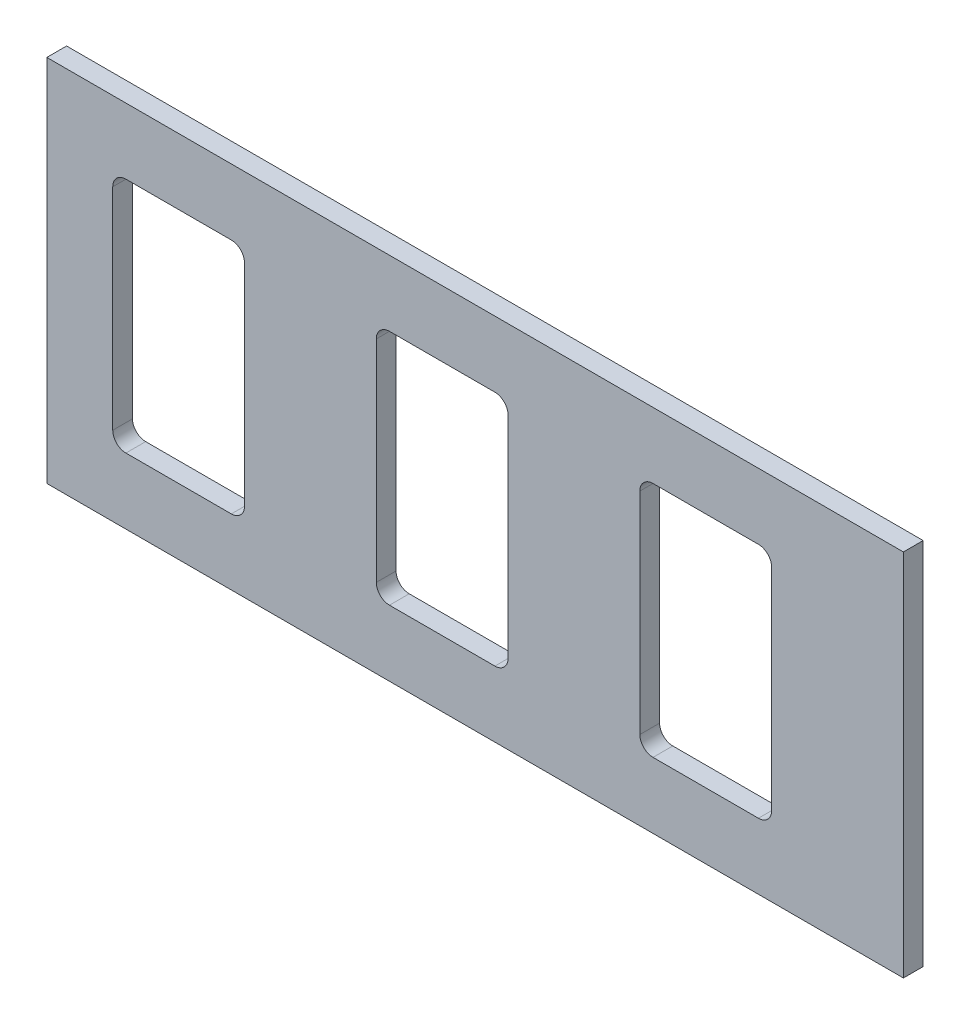
ISO-10303-21;
HEADER;
FILE_DESCRIPTION(('STEP AP214'),'2;1');
FILE_NAME('part.step','',(''),(''),'','','');
FILE_SCHEMA(('AUTOMOTIVE_DESIGN { 1 0 10303 214 1 1 1 1 }'));
ENDSEC;
DATA;
#1=APPLICATION_CONTEXT('core data for automotive mechanical design processes');
#2=APPLICATION_PROTOCOL_DEFINITION('international standard','automotive_design',2000,#1);
#3=PRODUCT_CONTEXT('',#1,'mechanical');
#4=PRODUCT('Part','Part','',(#3));
#5=PRODUCT_RELATED_PRODUCT_CATEGORY('part','',(#4));
#6=PRODUCT_DEFINITION_FORMATION('','',#4);
#7=PRODUCT_DEFINITION_CONTEXT('part definition',#1,'design');
#8=PRODUCT_DEFINITION('design','',#6,#7);
#9=PRODUCT_DEFINITION_SHAPE('','',#8);
#10=(LENGTH_UNIT() NAMED_UNIT(*) SI_UNIT(.MILLI.,.METRE.));
#11=(NAMED_UNIT(*) PLANE_ANGLE_UNIT() SI_UNIT($,.RADIAN.));
#12=(NAMED_UNIT(*) SI_UNIT($,.STERADIAN.) SOLID_ANGLE_UNIT());
#13=UNCERTAINTY_MEASURE_WITH_UNIT(LENGTH_MEASURE(1.E-05),#10,'distance_accuracy_value','');
#14=(GEOMETRIC_REPRESENTATION_CONTEXT(3) GLOBAL_UNCERTAINTY_ASSIGNED_CONTEXT((#13)) GLOBAL_UNIT_ASSIGNED_CONTEXT((#10,
#11,#12)) REPRESENTATION_CONTEXT('',''));
#15=CARTESIAN_POINT('',(0.,0.,0.));
#16=DIRECTION('',(0.,0.,1.));
#17=DIRECTION('',(1.,0.,0.));
#18=AXIS2_PLACEMENT_3D('',#15,#16,#17);
#19=CARTESIAN_POINT('',(-65.,-28.,3.));
#20=DIRECTION('',(1.,0.,0.));
#21=DIRECTION('',(0.,0.,-1.));
#22=AXIS2_PLACEMENT_3D('',#19,#20,#21);
#23=PLANE('',#22);
#24=DIRECTION('',(0.,-1.,0.));
#25=VECTOR('',#24,1.);
#26=CARTESIAN_POINT('',(-65.,-28.,0.));
#27=LINE('',#26,#25);
#28=CARTESIAN_POINT('',(-65.,28.,0.));
#29=VERTEX_POINT('',#28);
#30=CARTESIAN_POINT('',(-65.,-28.,0.));
#31=VERTEX_POINT('',#30);
#32=EDGE_CURVE('E246',#29,#31,#27,.T.);
#33=ORIENTED_EDGE('',*,*,#32,.T.);
#34=DIRECTION('',(0.,0.,-1.));
#35=VECTOR('',#34,1.);
#36=CARTESIAN_POINT('',(-65.,-28.,3.));
#37=LINE('',#36,#35);
#38=CARTESIAN_POINT('',(-65.,-28.,3.));
#39=VERTEX_POINT('',#38);
#40=EDGE_CURVE('E227',#39,#31,#37,.T.);
#41=ORIENTED_EDGE('',*,*,#40,.F.);
#42=DIRECTION('',(0.,-1.,0.));
#43=VECTOR('',#42,1.);
#44=CARTESIAN_POINT('',(-65.,-28.,3.));
#45=LINE('',#44,#43);
#46=CARTESIAN_POINT('',(-65.,28.,3.));
#47=VERTEX_POINT('',#46);
#48=EDGE_CURVE('E234',#47,#39,#45,.T.);
#49=ORIENTED_EDGE('',*,*,#48,.F.);
#50=DIRECTION('',(0.,0.,-1.));
#51=VECTOR('',#50,1.);
#52=CARTESIAN_POINT('',(-65.,28.,3.));
#53=LINE('',#52,#51);
#54=EDGE_CURVE('E464',#47,#29,#53,.T.);
#55=ORIENTED_EDGE('',*,*,#54,.T.);
#56=EDGE_LOOP('',(#33,#41,#49,#55));
#57=FACE_BOUND('',#56,.T.);
#58=ADVANCED_FACE('F37',(#57),#23,.F.);
#59=CARTESIAN_POINT('',(65.,-28.,3.));
#60=DIRECTION('',(0.,1.,0.));
#61=DIRECTION('',(-1.,0.,0.));
#62=AXIS2_PLACEMENT_3D('',#59,#60,#61);
#63=PLANE('',#62);
#64=DIRECTION('',(1.,0.,0.));
#65=VECTOR('',#64,1.);
#66=CARTESIAN_POINT('',(65.,-28.,0.));
#67=LINE('',#66,#65);
#68=CARTESIAN_POINT('',(65.,-28.,0.));
#69=VERTEX_POINT('',#68);
#70=EDGE_CURVE('E466',#31,#69,#67,.T.);
#71=ORIENTED_EDGE('',*,*,#70,.T.);
#72=DIRECTION('',(0.,0.,-1.));
#73=VECTOR('',#72,1.);
#74=CARTESIAN_POINT('',(65.,-28.,3.));
#75=LINE('',#74,#73);
#76=CARTESIAN_POINT('',(65.,-28.,3.));
#77=VERTEX_POINT('',#76);
#78=EDGE_CURVE('E230',#77,#69,#75,.T.);
#79=ORIENTED_EDGE('',*,*,#78,.F.);
#80=DIRECTION('',(1.,0.,0.));
#81=VECTOR('',#80,1.);
#82=CARTESIAN_POINT('',(65.,-28.,3.));
#83=LINE('',#82,#81);
#84=EDGE_CURVE('E223',#39,#77,#83,.T.);
#85=ORIENTED_EDGE('',*,*,#84,.F.);
#86=ORIENTED_EDGE('',*,*,#40,.T.);
#87=EDGE_LOOP('',(#71,#79,#85,#86));
#88=FACE_BOUND('',#87,.T.);
#89=ADVANCED_FACE('F225',(#88),#63,.F.);
#90=CARTESIAN_POINT('',(65.,-28.,3.));
#91=DIRECTION('',(-1.,0.,0.));
#92=DIRECTION('',(0.,0.,1.));
#93=AXIS2_PLACEMENT_3D('',#90,#91,#92);
#94=PLANE('',#93);
#95=DIRECTION('',(0.,1.,0.));
#96=VECTOR('',#95,1.);
#97=CARTESIAN_POINT('',(65.,-28.,0.));
#98=LINE('',#97,#96);
#99=CARTESIAN_POINT('',(65.,28.,0.));
#100=VERTEX_POINT('',#99);
#101=EDGE_CURVE('E468',#69,#100,#98,.T.);
#102=ORIENTED_EDGE('',*,*,#101,.T.);
#103=DIRECTION('',(0.,0.,-1.));
#104=VECTOR('',#103,1.);
#105=CARTESIAN_POINT('',(65.,28.,3.));
#106=LINE('',#105,#104);
#107=CARTESIAN_POINT('',(65.,28.,3.));
#108=VERTEX_POINT('',#107);
#109=EDGE_CURVE('E252',#108,#100,#106,.T.);
#110=ORIENTED_EDGE('',*,*,#109,.F.);
#111=DIRECTION('',(0.,1.,0.));
#112=VECTOR('',#111,1.);
#113=CARTESIAN_POINT('',(65.,-28.,3.));
#114=LINE('',#113,#112);
#115=EDGE_CURVE('E233',#77,#108,#114,.T.);
#116=ORIENTED_EDGE('',*,*,#115,.F.);
#117=ORIENTED_EDGE('',*,*,#78,.T.);
#118=EDGE_LOOP('',(#102,#110,#116,#117));
#119=FACE_BOUND('',#118,.T.);
#120=ADVANCED_FACE('F479',(#119),#94,.F.);
#121=CARTESIAN_POINT('',(65.,28.,3.));
#122=DIRECTION('',(0.,-1.,0.));
#123=DIRECTION('',(1.,0.,0.));
#124=AXIS2_PLACEMENT_3D('',#121,#122,#123);
#125=PLANE('',#124);
#126=DIRECTION('',(-1.,0.,0.));
#127=VECTOR('',#126,1.);
#128=CARTESIAN_POINT('',(65.,28.,0.));
#129=LINE('',#128,#127);
#130=EDGE_CURVE('E243',#100,#29,#129,.T.);
#131=ORIENTED_EDGE('',*,*,#130,.T.);
#132=ORIENTED_EDGE('',*,*,#54,.F.);
#133=DIRECTION('',(-1.,0.,0.));
#134=VECTOR('',#133,1.);
#135=CARTESIAN_POINT('',(65.,28.,3.));
#136=LINE('',#135,#134);
#137=EDGE_CURVE('E239',#108,#47,#136,.T.);
#138=ORIENTED_EDGE('',*,*,#137,.F.);
#139=ORIENTED_EDGE('',*,*,#109,.T.);
#140=EDGE_LOOP('',(#131,#132,#138,#139));
#141=FACE_BOUND('',#140,.T.);
#142=ADVANCED_FACE('F475',(#141),#125,.F.);
#143=CARTESIAN_POINT('',(0.,0.,3.));
#144=DIRECTION('',(0.,0.,1.));
#145=DIRECTION('',(1.,0.,0.));
#146=AXIS2_PLACEMENT_3D('',#143,#144,#145);
#147=PLANE('',#146);
#148=DIRECTION('',(-1.,0.,0.));
#149=VECTOR('',#148,1.);
#150=CARTESIAN_POINT('',(-34.9999999999999,18.,3.));
#151=LINE('',#150,#149);
#152=CARTESIAN_POINT('',(-36.9999999999999,18.,3.));
#153=VERTEX_POINT('',#152);
#154=CARTESIAN_POINT('',(-52.9999999999999,18.,3.));
#155=VERTEX_POINT('',#154);
#156=EDGE_CURVE('E403',#153,#155,#151,.T.);
#157=ORIENTED_EDGE('',*,*,#156,.F.);
#158=CARTESIAN_POINT('',(-36.9999999999999,16.,3.));
#159=DIRECTION('',(0.,0.,1.));
#160=DIRECTION('',(1.,0.,0.));
#161=AXIS2_PLACEMENT_3D('',#158,#159,#160);
#162=CIRCLE('',#161,2.);
#163=CARTESIAN_POINT('',(-34.9999999999999,16.,3.));
#164=VERTEX_POINT('',#163);
#165=EDGE_CURVE('E357',#153,#164,#162,.F.);
#166=ORIENTED_EDGE('',*,*,#165,.T.);
#167=DIRECTION('',(0.,1.,0.));
#168=VECTOR('',#167,1.);
#169=CARTESIAN_POINT('',(-34.9999999999999,-18.,3.));
#170=LINE('',#169,#168);
#171=CARTESIAN_POINT('',(-34.9999999999999,-16.,3.));
#172=VERTEX_POINT('',#171);
#173=EDGE_CURVE('E423',#172,#164,#170,.T.);
#174=ORIENTED_EDGE('',*,*,#173,.F.);
#175=CARTESIAN_POINT('',(-36.9999999999999,-16.,3.));
#176=DIRECTION('',(0.,0.,1.));
#177=DIRECTION('',(1.,0.,0.));
#178=AXIS2_PLACEMENT_3D('',#175,#176,#177);
#179=CIRCLE('',#178,2.);
#180=CARTESIAN_POINT('',(-36.9999999999999,-18.,3.));
#181=VERTEX_POINT('',#180);
#182=EDGE_CURVE('E369',#172,#181,#179,.F.);
#183=ORIENTED_EDGE('',*,*,#182,.T.);
#184=DIRECTION('',(1.,0.,0.));
#185=VECTOR('',#184,1.);
#186=CARTESIAN_POINT('',(-54.9999999999999,-18.,3.));
#187=LINE('',#186,#185);
#188=CARTESIAN_POINT('',(-52.9999999999999,-18.,3.));
#189=VERTEX_POINT('',#188);
#190=EDGE_CURVE('E395',#189,#181,#187,.T.);
#191=ORIENTED_EDGE('',*,*,#190,.F.);
#192=CARTESIAN_POINT('',(-52.9999999999999,-16.,3.));
#193=DIRECTION('',(0.,0.,1.));
#194=DIRECTION('',(1.,0.,0.));
#195=AXIS2_PLACEMENT_3D('',#192,#193,#194);
#196=CIRCLE('',#195,2.);
#197=CARTESIAN_POINT('',(-54.9999999999999,-16.,3.));
#198=VERTEX_POINT('',#197);
#199=EDGE_CURVE('E45',#189,#198,#196,.F.);
#200=ORIENTED_EDGE('',*,*,#199,.T.);
#201=DIRECTION('',(0.,-1.,0.));
#202=VECTOR('',#201,1.);
#203=CARTESIAN_POINT('',(-54.9999999999999,-18.,3.));
#204=LINE('',#203,#202);
#205=CARTESIAN_POINT('',(-54.9999999999999,16.,3.));
#206=VERTEX_POINT('',#205);
#207=EDGE_CURVE('E393',#206,#198,#204,.T.);
#208=ORIENTED_EDGE('',*,*,#207,.F.);
#209=CARTESIAN_POINT('',(-52.9999999999999,16.,3.));
#210=DIRECTION('',(0.,0.,1.));
#211=DIRECTION('',(1.,0.,0.));
#212=AXIS2_PLACEMENT_3D('',#209,#210,#211);
#213=CIRCLE('',#212,2.);
#214=EDGE_CURVE('E353',#206,#155,#213,.F.);
#215=ORIENTED_EDGE('',*,*,#214,.T.);
#216=EDGE_LOOP('',(#157,#166,#174,#183,#191,#200,#208,#215));
#217=FACE_BOUND('',#216,.T.);
#218=DIRECTION('',(-1.,0.,0.));
#219=VECTOR('',#218,1.);
#220=CARTESIAN_POINT('',(45.,18.,3.));
#221=LINE('',#220,#219);
#222=CARTESIAN_POINT('',(43.,18.,3.));
#223=VERTEX_POINT('',#222);
#224=CARTESIAN_POINT('',(27.,18.,3.));
#225=VERTEX_POINT('',#224);
#226=EDGE_CURVE('E444',#223,#225,#221,.T.);
#227=ORIENTED_EDGE('',*,*,#226,.F.);
#228=CARTESIAN_POINT('',(43.,16.,3.));
#229=DIRECTION('',(0.,0.,1.));
#230=DIRECTION('',(1.,0.,0.));
#231=AXIS2_PLACEMENT_3D('',#228,#229,#230);
#232=CIRCLE('',#231,2.);
#233=CARTESIAN_POINT('',(45.,16.,3.));
#234=VERTEX_POINT('',#233);
#235=EDGE_CURVE('E365',#223,#234,#232,.F.);
#236=ORIENTED_EDGE('',*,*,#235,.T.);
#237=DIRECTION('',(0.,1.,0.));
#238=VECTOR('',#237,1.);
#239=CARTESIAN_POINT('',(45.,-18.,3.));
#240=LINE('',#239,#238);
#241=CARTESIAN_POINT('',(45.,-16.,3.));
#242=VERTEX_POINT('',#241);
#243=EDGE_CURVE('E435',#242,#234,#240,.T.);
#244=ORIENTED_EDGE('',*,*,#243,.F.);
#245=CARTESIAN_POINT('',(43.,-16.,3.));
#246=DIRECTION('',(0.,0.,1.));
#247=DIRECTION('',(1.,0.,0.));
#248=AXIS2_PLACEMENT_3D('',#245,#246,#247);
#249=CIRCLE('',#248,2.);
#250=CARTESIAN_POINT('',(43.,-18.,3.));
#251=VERTEX_POINT('',#250);
#252=EDGE_CURVE('E377',#242,#251,#249,.F.);
#253=ORIENTED_EDGE('',*,*,#252,.T.);
#254=DIRECTION('',(1.,0.,0.));
#255=VECTOR('',#254,1.);
#256=CARTESIAN_POINT('',(25.,-18.,3.));
#257=LINE('',#256,#255);
#258=CARTESIAN_POINT('',(27.,-18.,3.));
#259=VERTEX_POINT('',#258);
#260=EDGE_CURVE('E438',#259,#251,#257,.T.);
#261=ORIENTED_EDGE('',*,*,#260,.F.);
#262=CARTESIAN_POINT('',(27.,-16.,3.));
#263=DIRECTION('',(0.,0.,1.));
#264=DIRECTION('',(1.,0.,0.));
#265=AXIS2_PLACEMENT_3D('',#262,#263,#264);
#266=CIRCLE('',#265,2.);
#267=CARTESIAN_POINT('',(25.,-16.,3.));
#268=VERTEX_POINT('',#267);
#269=EDGE_CURVE('E381',#259,#268,#266,.F.);
#270=ORIENTED_EDGE('',*,*,#269,.T.);
#271=DIRECTION('',(0.,-1.,0.));
#272=VECTOR('',#271,1.);
#273=CARTESIAN_POINT('',(25.,-18.,3.));
#274=LINE('',#273,#272);
#275=CARTESIAN_POINT('',(25.,16.,3.));
#276=VERTEX_POINT('',#275);
#277=EDGE_CURVE('E447',#276,#268,#274,.T.);
#278=ORIENTED_EDGE('',*,*,#277,.F.);
#279=CARTESIAN_POINT('',(27.,16.,3.));
#280=DIRECTION('',(0.,0.,1.));
#281=DIRECTION('',(1.,0.,0.));
#282=AXIS2_PLACEMENT_3D('',#279,#280,#281);
#283=CIRCLE('',#282,2.);
#284=EDGE_CURVE('E345',#276,#225,#283,.F.);
#285=ORIENTED_EDGE('',*,*,#284,.T.);
#286=EDGE_LOOP('',(#227,#236,#244,#253,#261,#270,#278,#285));
#287=FACE_BOUND('',#286,.T.);
#288=DIRECTION('',(1.,0.,0.));
#289=VECTOR('',#288,1.);
#290=CARTESIAN_POINT('',(-14.9999999999999,-18.,3.));
#291=LINE('',#290,#289);
#292=CARTESIAN_POINT('',(-12.9999999999999,-18.,3.));
#293=VERTEX_POINT('',#292);
#294=CARTESIAN_POINT('',(3.00000000000004,-18.,3.));
#295=VERTEX_POINT('',#294);
#296=EDGE_CURVE('E443',#293,#295,#291,.T.);
#297=ORIENTED_EDGE('',*,*,#296,.F.);
#298=CARTESIAN_POINT('',(-12.9999999999999,-16.,3.));
#299=DIRECTION('',(0.,0.,1.));
#300=DIRECTION('',(1.,0.,0.));
#301=AXIS2_PLACEMENT_3D('',#298,#299,#300);
#302=CIRCLE('',#301,2.);
#303=CARTESIAN_POINT('',(-14.9999999999999,-16.,3.));
#304=VERTEX_POINT('',#303);
#305=EDGE_CURVE('E384',#293,#304,#302,.F.);
#306=ORIENTED_EDGE('',*,*,#305,.T.);
#307=DIRECTION('',(0.,-1.,0.));
#308=VECTOR('',#307,1.);
#309=CARTESIAN_POINT('',(-14.9999999999999,-18.,3.));
#310=LINE('',#309,#308);
#311=CARTESIAN_POINT('',(-14.9999999999999,16.,3.));
#312=VERTEX_POINT('',#311);
#313=EDGE_CURVE('E459',#312,#304,#310,.T.);
#314=ORIENTED_EDGE('',*,*,#313,.F.);
#315=CARTESIAN_POINT('',(-12.9999999999999,16.,3.));
#316=DIRECTION('',(0.,0.,1.));
#317=DIRECTION('',(1.,0.,0.));
#318=AXIS2_PLACEMENT_3D('',#315,#316,#317);
#319=CIRCLE('',#318,2.);
#320=CARTESIAN_POINT('',(-12.9999999999999,18.,3.));
#321=VERTEX_POINT('',#320);
#322=EDGE_CURVE('E349',#312,#321,#319,.F.);
#323=ORIENTED_EDGE('',*,*,#322,.T.);
#324=DIRECTION('',(-1.,0.,0.));
#325=VECTOR('',#324,1.);
#326=CARTESIAN_POINT('',(5.00000000000004,18.,3.));
#327=LINE('',#326,#325);
#328=CARTESIAN_POINT('',(3.00000000000004,18.,3.));
#329=VERTEX_POINT('',#328);
#330=EDGE_CURVE('E456',#329,#321,#327,.T.);
#331=ORIENTED_EDGE('',*,*,#330,.F.);
#332=CARTESIAN_POINT('',(3.00000000000004,16.,3.));
#333=DIRECTION('',(0.,0.,1.));
#334=DIRECTION('',(1.,0.,0.));
#335=AXIS2_PLACEMENT_3D('',#332,#333,#334);
#336=CIRCLE('',#335,2.);
#337=CARTESIAN_POINT('',(5.00000000000004,16.,3.));
#338=VERTEX_POINT('',#337);
#339=EDGE_CURVE('E361',#329,#338,#336,.F.);
#340=ORIENTED_EDGE('',*,*,#339,.T.);
#341=DIRECTION('',(0.,1.,0.));
#342=VECTOR('',#341,1.);
#343=CARTESIAN_POINT('',(5.00000000000004,-18.,3.));
#344=LINE('',#343,#342);
#345=CARTESIAN_POINT('',(5.00000000000004,-16.,3.));
#346=VERTEX_POINT('',#345);
#347=EDGE_CURVE('E453',#346,#338,#344,.T.);
#348=ORIENTED_EDGE('',*,*,#347,.F.);
#349=CARTESIAN_POINT('',(3.00000000000004,-16.,3.));
#350=DIRECTION('',(0.,0.,1.));
#351=DIRECTION('',(1.,0.,0.));
#352=AXIS2_PLACEMENT_3D('',#349,#350,#351);
#353=CIRCLE('',#352,2.);
#354=EDGE_CURVE('E373',#346,#295,#353,.F.);
#355=ORIENTED_EDGE('',*,*,#354,.T.);
#356=EDGE_LOOP('',(#297,#306,#314,#323,#331,#340,#348,#355));
#357=FACE_BOUND('',#356,.T.);
#358=ORIENTED_EDGE('',*,*,#48,.T.);
#359=ORIENTED_EDGE('',*,*,#84,.T.);
#360=ORIENTED_EDGE('',*,*,#115,.T.);
#361=ORIENTED_EDGE('',*,*,#137,.T.);
#362=EDGE_LOOP('',(#358,#359,#360,#361));
#363=FACE_BOUND('',#362,.T.);
#364=ADVANCED_FACE('F237',(#217,#287,#357,#363),#147,.T.);
#365=CARTESIAN_POINT('',(0.,0.,0.));
#366=DIRECTION('',(0.,0.,1.));
#367=DIRECTION('',(1.,0.,0.));
#368=AXIS2_PLACEMENT_3D('',#365,#366,#367);
#369=PLANE('',#368);
#370=DIRECTION('',(1.,0.,0.));
#371=VECTOR('',#370,1.);
#372=CARTESIAN_POINT('',(0.,-18.,0.));
#373=LINE('',#372,#371);
#374=CARTESIAN_POINT('',(-52.9999999999999,-18.,0.));
#375=VERTEX_POINT('',#374);
#376=CARTESIAN_POINT('',(-36.9999999999999,-18.,0.));
#377=VERTEX_POINT('',#376);
#378=EDGE_CURVE('E277',#375,#377,#373,.T.);
#379=ORIENTED_EDGE('',*,*,#378,.T.);
#380=CARTESIAN_POINT('',(-36.9999999999999,-16.,0.));
#381=DIRECTION('',(0.,0.,1.));
#382=DIRECTION('',(1.,0.,0.));
#383=AXIS2_PLACEMENT_3D('',#380,#381,#382);
#384=CIRCLE('',#383,2.);
#385=CARTESIAN_POINT('',(-34.9999999999999,-16.,0.));
#386=VERTEX_POINT('',#385);
#387=EDGE_CURVE('E371',#377,#386,#384,.T.);
#388=ORIENTED_EDGE('',*,*,#387,.T.);
#389=DIRECTION('',(0.,1.,0.));
#390=VECTOR('',#389,1.);
#391=CARTESIAN_POINT('',(-34.9999999999999,0.,0.));
#392=LINE('',#391,#390);
#393=CARTESIAN_POINT('',(-34.9999999999999,16.,0.));
#394=VERTEX_POINT('',#393);
#395=EDGE_CURVE('E280',#386,#394,#392,.T.);
#396=ORIENTED_EDGE('',*,*,#395,.T.);
#397=CARTESIAN_POINT('',(-36.9999999999999,16.,0.));
#398=DIRECTION('',(0.,0.,1.));
#399=DIRECTION('',(1.,0.,0.));
#400=AXIS2_PLACEMENT_3D('',#397,#398,#399);
#401=CIRCLE('',#400,2.);
#402=CARTESIAN_POINT('',(-36.9999999999999,18.,0.));
#403=VERTEX_POINT('',#402);
#404=EDGE_CURVE('E359',#394,#403,#401,.T.);
#405=ORIENTED_EDGE('',*,*,#404,.T.);
#406=DIRECTION('',(-1.,0.,0.));
#407=VECTOR('',#406,1.);
#408=CARTESIAN_POINT('',(0.,18.,0.));
#409=LINE('',#408,#407);
#410=CARTESIAN_POINT('',(-52.9999999999999,18.,0.));
#411=VERTEX_POINT('',#410);
#412=EDGE_CURVE('E283',#403,#411,#409,.T.);
#413=ORIENTED_EDGE('',*,*,#412,.T.);
#414=CARTESIAN_POINT('',(-52.9999999999999,16.,0.));
#415=DIRECTION('',(0.,0.,1.));
#416=DIRECTION('',(1.,0.,0.));
#417=AXIS2_PLACEMENT_3D('',#414,#415,#416);
#418=CIRCLE('',#417,2.);
#419=CARTESIAN_POINT('',(-54.9999999999999,16.,0.));
#420=VERTEX_POINT('',#419);
#421=EDGE_CURVE('E355',#411,#420,#418,.T.);
#422=ORIENTED_EDGE('',*,*,#421,.T.);
#423=DIRECTION('',(0.,-1.,0.));
#424=VECTOR('',#423,1.);
#425=CARTESIAN_POINT('',(-54.9999999999999,0.,0.));
#426=LINE('',#425,#424);
#427=CARTESIAN_POINT('',(-54.9999999999999,-16.,0.));
#428=VERTEX_POINT('',#427);
#429=EDGE_CURVE('E274',#420,#428,#426,.T.);
#430=ORIENTED_EDGE('',*,*,#429,.T.);
#431=CARTESIAN_POINT('',(-52.9999999999999,-16.,0.));
#432=DIRECTION('',(0.,0.,1.));
#433=DIRECTION('',(1.,0.,0.));
#434=AXIS2_PLACEMENT_3D('',#431,#432,#433);
#435=CIRCLE('',#434,2.);
#436=EDGE_CURVE('E11',#428,#375,#435,.T.);
#437=ORIENTED_EDGE('',*,*,#436,.T.);
#438=EDGE_LOOP('',(#379,#388,#396,#405,#413,#422,#430,#437));
#439=FACE_BOUND('',#438,.T.);
#440=DIRECTION('',(1.,0.,0.));
#441=VECTOR('',#440,1.);
#442=CARTESIAN_POINT('',(0.,-18.,0.));
#443=LINE('',#442,#441);
#444=CARTESIAN_POINT('',(27.,-18.,0.));
#445=VERTEX_POINT('',#444);
#446=CARTESIAN_POINT('',(43.,-18.,0.));
#447=VERTEX_POINT('',#446);
#448=EDGE_CURVE('E266',#445,#447,#443,.T.);
#449=ORIENTED_EDGE('',*,*,#448,.T.);
#450=CARTESIAN_POINT('',(43.,-16.,0.));
#451=DIRECTION('',(0.,0.,1.));
#452=DIRECTION('',(1.,0.,0.));
#453=AXIS2_PLACEMENT_3D('',#450,#451,#452);
#454=CIRCLE('',#453,2.);
#455=CARTESIAN_POINT('',(45.,-16.,0.));
#456=VERTEX_POINT('',#455);
#457=EDGE_CURVE('E379',#447,#456,#454,.T.);
#458=ORIENTED_EDGE('',*,*,#457,.T.);
#459=DIRECTION('',(0.,1.,0.));
#460=VECTOR('',#459,1.);
#461=CARTESIAN_POINT('',(45.,0.,0.));
#462=LINE('',#461,#460);
#463=CARTESIAN_POINT('',(45.,16.,0.));
#464=VERTEX_POINT('',#463);
#465=EDGE_CURVE('E268',#456,#464,#462,.T.);
#466=ORIENTED_EDGE('',*,*,#465,.T.);
#467=CARTESIAN_POINT('',(43.,16.,0.));
#468=DIRECTION('',(0.,0.,1.));
#469=DIRECTION('',(1.,0.,0.));
#470=AXIS2_PLACEMENT_3D('',#467,#468,#469);
#471=CIRCLE('',#470,2.);
#472=CARTESIAN_POINT('',(43.,18.,0.));
#473=VERTEX_POINT('',#472);
#474=EDGE_CURVE('E367',#464,#473,#471,.T.);
#475=ORIENTED_EDGE('',*,*,#474,.T.);
#476=DIRECTION('',(-1.,0.,0.));
#477=VECTOR('',#476,1.);
#478=CARTESIAN_POINT('',(0.,18.,0.));
#479=LINE('',#478,#477);
#480=CARTESIAN_POINT('',(27.,18.,0.));
#481=VERTEX_POINT('',#480);
#482=EDGE_CURVE('E271',#473,#481,#479,.T.);
#483=ORIENTED_EDGE('',*,*,#482,.T.);
#484=CARTESIAN_POINT('',(27.,16.,0.));
#485=DIRECTION('',(0.,0.,1.));
#486=DIRECTION('',(1.,0.,0.));
#487=AXIS2_PLACEMENT_3D('',#484,#485,#486);
#488=CIRCLE('',#487,2.);
#489=CARTESIAN_POINT('',(25.,16.,0.));
#490=VERTEX_POINT('',#489);
#491=EDGE_CURVE('E347',#481,#490,#488,.T.);
#492=ORIENTED_EDGE('',*,*,#491,.T.);
#493=DIRECTION('',(0.,-1.,0.));
#494=VECTOR('',#493,1.);
#495=CARTESIAN_POINT('',(25.,0.,0.));
#496=LINE('',#495,#494);
#497=CARTESIAN_POINT('',(25.,-16.,0.));
#498=VERTEX_POINT('',#497);
#499=EDGE_CURVE('E264',#490,#498,#496,.T.);
#500=ORIENTED_EDGE('',*,*,#499,.T.);
#501=CARTESIAN_POINT('',(27.,-16.,0.));
#502=DIRECTION('',(0.,0.,1.));
#503=DIRECTION('',(1.,0.,0.));
#504=AXIS2_PLACEMENT_3D('',#501,#502,#503);
#505=CIRCLE('',#504,2.);
#506=EDGE_CURVE('E59',#498,#445,#505,.T.);
#507=ORIENTED_EDGE('',*,*,#506,.T.);
#508=EDGE_LOOP('',(#449,#458,#466,#475,#483,#492,#500,#507));
#509=FACE_BOUND('',#508,.T.);
#510=DIRECTION('',(-1.,0.,0.));
#511=VECTOR('',#510,1.);
#512=CARTESIAN_POINT('',(0.,18.,0.));
#513=LINE('',#512,#511);
#514=CARTESIAN_POINT('',(3.00000000000004,18.,0.));
#515=VERTEX_POINT('',#514);
#516=CARTESIAN_POINT('',(-12.9999999999999,18.,0.));
#517=VERTEX_POINT('',#516);
#518=EDGE_CURVE('E250',#515,#517,#513,.T.);
#519=ORIENTED_EDGE('',*,*,#518,.T.);
#520=CARTESIAN_POINT('',(-12.9999999999999,16.,0.));
#521=DIRECTION('',(0.,0.,1.));
#522=DIRECTION('',(1.,0.,0.));
#523=AXIS2_PLACEMENT_3D('',#520,#521,#522);
#524=CIRCLE('',#523,2.);
#525=CARTESIAN_POINT('',(-14.9999999999999,16.,0.));
#526=VERTEX_POINT('',#525);
#527=EDGE_CURVE('E351',#517,#526,#524,.T.);
#528=ORIENTED_EDGE('',*,*,#527,.T.);
#529=DIRECTION('',(0.,-1.,0.));
#530=VECTOR('',#529,1.);
#531=CARTESIAN_POINT('',(-14.9999999999999,0.,0.));
#532=LINE('',#531,#530);
#533=CARTESIAN_POINT('',(-14.9999999999999,-16.,0.));
#534=VERTEX_POINT('',#533);
#535=EDGE_CURVE('E258',#526,#534,#532,.T.);
#536=ORIENTED_EDGE('',*,*,#535,.T.);
#537=CARTESIAN_POINT('',(-12.9999999999999,-16.,0.));
#538=DIRECTION('',(0.,0.,1.));
#539=DIRECTION('',(1.,0.,0.));
#540=AXIS2_PLACEMENT_3D('',#537,#538,#539);
#541=CIRCLE('',#540,2.);
#542=CARTESIAN_POINT('',(-12.9999999999999,-18.,0.));
#543=VERTEX_POINT('',#542);
#544=EDGE_CURVE('E386',#534,#543,#541,.T.);
#545=ORIENTED_EDGE('',*,*,#544,.T.);
#546=DIRECTION('',(1.,0.,0.));
#547=VECTOR('',#546,1.);
#548=CARTESIAN_POINT('',(0.,-18.,0.));
#549=LINE('',#548,#547);
#550=CARTESIAN_POINT('',(3.00000000000004,-18.,0.));
#551=VERTEX_POINT('',#550);
#552=EDGE_CURVE('E261',#543,#551,#549,.T.);
#553=ORIENTED_EDGE('',*,*,#552,.T.);
#554=CARTESIAN_POINT('',(3.00000000000004,-16.,0.));
#555=DIRECTION('',(0.,0.,1.));
#556=DIRECTION('',(1.,0.,0.));
#557=AXIS2_PLACEMENT_3D('',#554,#555,#556);
#558=CIRCLE('',#557,2.);
#559=CARTESIAN_POINT('',(5.00000000000004,-16.,0.));
#560=VERTEX_POINT('',#559);
#561=EDGE_CURVE('E375',#551,#560,#558,.T.);
#562=ORIENTED_EDGE('',*,*,#561,.T.);
#563=DIRECTION('',(0.,1.,0.));
#564=VECTOR('',#563,1.);
#565=CARTESIAN_POINT('',(5.00000000000004,0.,0.));
#566=LINE('',#565,#564);
#567=CARTESIAN_POINT('',(5.00000000000004,16.,0.));
#568=VERTEX_POINT('',#567);
#569=EDGE_CURVE('E247',#560,#568,#566,.T.);
#570=ORIENTED_EDGE('',*,*,#569,.T.);
#571=CARTESIAN_POINT('',(3.00000000000004,16.,0.));
#572=DIRECTION('',(0.,0.,1.));
#573=DIRECTION('',(1.,0.,0.));
#574=AXIS2_PLACEMENT_3D('',#571,#572,#573);
#575=CIRCLE('',#574,2.);
#576=EDGE_CURVE('E363',#568,#515,#575,.T.);
#577=ORIENTED_EDGE('',*,*,#576,.T.);
#578=EDGE_LOOP('',(#519,#528,#536,#545,#553,#562,#570,#577));
#579=FACE_BOUND('',#578,.T.);
#580=ORIENTED_EDGE('',*,*,#32,.F.);
#581=ORIENTED_EDGE('',*,*,#130,.F.);
#582=ORIENTED_EDGE('',*,*,#101,.F.);
#583=ORIENTED_EDGE('',*,*,#70,.F.);
#584=EDGE_LOOP('',(#580,#581,#582,#583));
#585=FACE_BOUND('',#584,.T.);
#586=ADVANCED_FACE('F408',(#439,#509,#579,#585),#369,.F.);
#587=CARTESIAN_POINT('',(-14.9999999999999,-18.,-2.));
#588=DIRECTION('',(0.,-1.,0.));
#589=DIRECTION('',(1.,0.,0.));
#590=AXIS2_PLACEMENT_3D('',#587,#588,#589);
#591=PLANE('',#590);
#592=ORIENTED_EDGE('',*,*,#296,.T.);
#593=DIRECTION('',(0.,0.,1.));
#594=VECTOR('',#593,1.);
#595=CARTESIAN_POINT('',(3.00000000000004,-18.,0.));
#596=LINE('',#595,#594);
#597=EDGE_CURVE('E339',#295,#551,#596,.F.);
#598=ORIENTED_EDGE('',*,*,#597,.T.);
#599=ORIENTED_EDGE('',*,*,#552,.F.);
#600=DIRECTION('',(0.,0.,1.));
#601=VECTOR('',#600,1.);
#602=CARTESIAN_POINT('',(-12.9999999999999,-18.,3.));
#603=LINE('',#602,#601);
#604=EDGE_CURVE('E336',#543,#293,#603,.T.);
#605=ORIENTED_EDGE('',*,*,#604,.T.);
#606=EDGE_LOOP('',(#592,#598,#599,#605));
#607=FACE_BOUND('',#606,.T.);
#608=ADVANCED_FACE('F540',(#607),#591,.F.);
#609=CARTESIAN_POINT('',(-14.9999999999999,-18.,-2.));
#610=DIRECTION('',(-1.,0.,0.));
#611=DIRECTION('',(0.,0.,1.));
#612=AXIS2_PLACEMENT_3D('',#609,#610,#611);
#613=PLANE('',#612);
#614=ORIENTED_EDGE('',*,*,#535,.F.);
#615=DIRECTION('',(0.,0.,1.));
#616=VECTOR('',#615,1.);
#617=CARTESIAN_POINT('',(-14.9999999999999,16.,3.));
#618=LINE('',#617,#616);
#619=EDGE_CURVE('E298',#526,#312,#618,.T.);
#620=ORIENTED_EDGE('',*,*,#619,.T.);
#621=ORIENTED_EDGE('',*,*,#313,.T.);
#622=DIRECTION('',(0.,0.,1.));
#623=VECTOR('',#622,1.);
#624=CARTESIAN_POINT('',(-14.9999999999999,-16.,0.));
#625=LINE('',#624,#623);
#626=EDGE_CURVE('E296',#304,#534,#625,.F.);
#627=ORIENTED_EDGE('',*,*,#626,.T.);
#628=EDGE_LOOP('',(#614,#620,#621,#627));
#629=FACE_BOUND('',#628,.T.);
#630=ADVANCED_FACE('F559',(#629),#613,.F.);
#631=CARTESIAN_POINT('',(5.00000000000004,18.,-2.));
#632=DIRECTION('',(0.,1.,0.));
#633=DIRECTION('',(-1.,0.,0.));
#634=AXIS2_PLACEMENT_3D('',#631,#632,#633);
#635=PLANE('',#634);
#636=ORIENTED_EDGE('',*,*,#330,.T.);
#637=DIRECTION('',(0.,0.,1.));
#638=VECTOR('',#637,1.);
#639=CARTESIAN_POINT('',(-12.9999999999999,18.,0.));
#640=LINE('',#639,#638);
#641=EDGE_CURVE('E304',#321,#517,#640,.F.);
#642=ORIENTED_EDGE('',*,*,#641,.T.);
#643=ORIENTED_EDGE('',*,*,#518,.F.);
#644=DIRECTION('',(0.,0.,1.));
#645=VECTOR('',#644,1.);
#646=CARTESIAN_POINT('',(3.00000000000004,18.,3.));
#647=LINE('',#646,#645);
#648=EDGE_CURVE('E301',#515,#329,#647,.T.);
#649=ORIENTED_EDGE('',*,*,#648,.T.);
#650=EDGE_LOOP('',(#636,#642,#643,#649));
#651=FACE_BOUND('',#650,.T.);
#652=ADVANCED_FACE('F554',(#651),#635,.F.);
#653=CARTESIAN_POINT('',(5.00000000000004,-18.,-2.));
#654=DIRECTION('',(1.,0.,0.));
#655=DIRECTION('',(0.,0.,-1.));
#656=AXIS2_PLACEMENT_3D('',#653,#654,#655);
#657=PLANE('',#656);
#658=ORIENTED_EDGE('',*,*,#347,.T.);
#659=DIRECTION('',(0.,0.,1.));
#660=VECTOR('',#659,1.);
#661=CARTESIAN_POINT('',(5.00000000000004,16.,0.));
#662=LINE('',#661,#660);
#663=EDGE_CURVE('E324',#338,#568,#662,.F.);
#664=ORIENTED_EDGE('',*,*,#663,.T.);
#665=ORIENTED_EDGE('',*,*,#569,.F.);
#666=DIRECTION('',(0.,0.,1.));
#667=VECTOR('',#666,1.);
#668=CARTESIAN_POINT('',(5.00000000000004,-16.,3.));
#669=LINE('',#668,#667);
#670=EDGE_CURVE('E321',#560,#346,#669,.T.);
#671=ORIENTED_EDGE('',*,*,#670,.T.);
#672=EDGE_LOOP('',(#658,#664,#665,#671));
#673=FACE_BOUND('',#672,.T.);
#674=ADVANCED_FACE('F547',(#673),#657,.F.);
#675=CARTESIAN_POINT('',(45.,18.,-2.));
#676=DIRECTION('',(0.,1.,0.));
#677=DIRECTION('',(-1.,0.,0.));
#678=AXIS2_PLACEMENT_3D('',#675,#676,#677);
#679=PLANE('',#678);
#680=ORIENTED_EDGE('',*,*,#226,.T.);
#681=DIRECTION('',(0.,0.,1.));
#682=VECTOR('',#681,1.);
#683=CARTESIAN_POINT('',(27.,18.,0.));
#684=LINE('',#683,#682);
#685=EDGE_CURVE('E294',#225,#481,#684,.F.);
#686=ORIENTED_EDGE('',*,*,#685,.T.);
#687=ORIENTED_EDGE('',*,*,#482,.F.);
#688=DIRECTION('',(0.,0.,1.));
#689=VECTOR('',#688,1.);
#690=CARTESIAN_POINT('',(43.,18.,3.));
#691=LINE('',#690,#689);
#692=EDGE_CURVE('E291',#473,#223,#691,.T.);
#693=ORIENTED_EDGE('',*,*,#692,.T.);
#694=EDGE_LOOP('',(#680,#686,#687,#693));
#695=FACE_BOUND('',#694,.T.);
#696=ADVANCED_FACE('F573',(#695),#679,.F.);
#697=CARTESIAN_POINT('',(45.,-18.,-2.));
#698=DIRECTION('',(1.,0.,0.));
#699=DIRECTION('',(0.,0.,-1.));
#700=AXIS2_PLACEMENT_3D('',#697,#698,#699);
#701=PLANE('',#700);
#702=ORIENTED_EDGE('',*,*,#243,.T.);
#703=DIRECTION('',(0.,0.,1.));
#704=VECTOR('',#703,1.);
#705=CARTESIAN_POINT('',(45.,16.,0.));
#706=LINE('',#705,#704);
#707=EDGE_CURVE('E329',#234,#464,#706,.F.);
#708=ORIENTED_EDGE('',*,*,#707,.T.);
#709=ORIENTED_EDGE('',*,*,#465,.F.);
#710=DIRECTION('',(0.,0.,1.));
#711=VECTOR('',#710,1.);
#712=CARTESIAN_POINT('',(45.,-16.,3.));
#713=LINE('',#712,#711);
#714=EDGE_CURVE('E326',#456,#242,#713,.T.);
#715=ORIENTED_EDGE('',*,*,#714,.T.);
#716=EDGE_LOOP('',(#702,#708,#709,#715));
#717=FACE_BOUND('',#716,.T.);
#718=ADVANCED_FACE('F580',(#717),#701,.F.);
#719=CARTESIAN_POINT('',(25.,-18.,-2.));
#720=DIRECTION('',(0.,-1.,0.));
#721=DIRECTION('',(1.,0.,0.));
#722=AXIS2_PLACEMENT_3D('',#719,#720,#721);
#723=PLANE('',#722);
#724=ORIENTED_EDGE('',*,*,#260,.T.);
#725=DIRECTION('',(0.,0.,1.));
#726=VECTOR('',#725,1.);
#727=CARTESIAN_POINT('',(43.,-18.,0.));
#728=LINE('',#727,#726);
#729=EDGE_CURVE('E52',#251,#447,#728,.F.);
#730=ORIENTED_EDGE('',*,*,#729,.T.);
#731=ORIENTED_EDGE('',*,*,#448,.F.);
#732=DIRECTION('',(0.,0.,1.));
#733=VECTOR('',#732,1.);
#734=CARTESIAN_POINT('',(27.,-18.,3.));
#735=LINE('',#734,#733);
#736=EDGE_CURVE('E341',#445,#259,#735,.T.);
#737=ORIENTED_EDGE('',*,*,#736,.T.);
#738=EDGE_LOOP('',(#724,#730,#731,#737));
#739=FACE_BOUND('',#738,.T.);
#740=ADVANCED_FACE('F585',(#739),#723,.F.);
#741=CARTESIAN_POINT('',(25.,-18.,-2.));
#742=DIRECTION('',(-1.,0.,0.));
#743=DIRECTION('',(0.,0.,1.));
#744=AXIS2_PLACEMENT_3D('',#741,#742,#743);
#745=PLANE('',#744);
#746=ORIENTED_EDGE('',*,*,#499,.F.);
#747=DIRECTION('',(0.,0.,1.));
#748=VECTOR('',#747,1.);
#749=CARTESIAN_POINT('',(25.,16.,3.));
#750=LINE('',#749,#748);
#751=EDGE_CURVE('E288',#490,#276,#750,.T.);
#752=ORIENTED_EDGE('',*,*,#751,.T.);
#753=ORIENTED_EDGE('',*,*,#277,.T.);
#754=DIRECTION('',(0.,0.,1.));
#755=VECTOR('',#754,1.);
#756=CARTESIAN_POINT('',(25.,-16.,0.));
#757=LINE('',#756,#755);
#758=EDGE_CURVE('E286',#268,#498,#757,.F.);
#759=ORIENTED_EDGE('',*,*,#758,.T.);
#760=EDGE_LOOP('',(#746,#752,#753,#759));
#761=FACE_BOUND('',#760,.T.);
#762=ADVANCED_FACE('F582',(#761),#745,.F.);
#763=CARTESIAN_POINT('',(-34.9999999999999,18.,-2.));
#764=DIRECTION('',(0.,1.,0.));
#765=DIRECTION('',(-1.,0.,0.));
#766=AXIS2_PLACEMENT_3D('',#763,#764,#765);
#767=PLANE('',#766);
#768=ORIENTED_EDGE('',*,*,#156,.T.);
#769=DIRECTION('',(0.,0.,1.));
#770=VECTOR('',#769,1.);
#771=CARTESIAN_POINT('',(-52.9999999999999,18.,0.));
#772=LINE('',#771,#770);
#773=EDGE_CURVE('E314',#155,#411,#772,.F.);
#774=ORIENTED_EDGE('',*,*,#773,.T.);
#775=ORIENTED_EDGE('',*,*,#412,.F.);
#776=DIRECTION('',(0.,0.,1.));
#777=VECTOR('',#776,1.);
#778=CARTESIAN_POINT('',(-36.9999999999999,18.,3.));
#779=LINE('',#778,#777);
#780=EDGE_CURVE('E311',#403,#153,#779,.T.);
#781=ORIENTED_EDGE('',*,*,#780,.T.);
#782=EDGE_LOOP('',(#768,#774,#775,#781));
#783=FACE_BOUND('',#782,.T.);
#784=ADVANCED_FACE('F431',(#783),#767,.F.);
#785=CARTESIAN_POINT('',(-34.9999999999999,-18.,-2.));
#786=DIRECTION('',(1.,0.,0.));
#787=DIRECTION('',(0.,0.,-1.));
#788=AXIS2_PLACEMENT_3D('',#785,#786,#787);
#789=PLANE('',#788);
#790=ORIENTED_EDGE('',*,*,#173,.T.);
#791=DIRECTION('',(0.,0.,1.));
#792=VECTOR('',#791,1.);
#793=CARTESIAN_POINT('',(-34.9999999999999,16.,0.));
#794=LINE('',#793,#792);
#795=EDGE_CURVE('E319',#164,#394,#794,.F.);
#796=ORIENTED_EDGE('',*,*,#795,.T.);
#797=ORIENTED_EDGE('',*,*,#395,.F.);
#798=DIRECTION('',(0.,0.,1.));
#799=VECTOR('',#798,1.);
#800=CARTESIAN_POINT('',(-34.9999999999999,-16.,3.));
#801=LINE('',#800,#799);
#802=EDGE_CURVE('E316',#386,#172,#801,.T.);
#803=ORIENTED_EDGE('',*,*,#802,.T.);
#804=EDGE_LOOP('',(#790,#796,#797,#803));
#805=FACE_BOUND('',#804,.T.);
#806=ADVANCED_FACE('F420',(#805),#789,.F.);
#807=CARTESIAN_POINT('',(-54.9999999999999,-18.,-2.));
#808=DIRECTION('',(0.,-1.,0.));
#809=DIRECTION('',(1.,0.,0.));
#810=AXIS2_PLACEMENT_3D('',#807,#808,#809);
#811=PLANE('',#810);
#812=ORIENTED_EDGE('',*,*,#190,.T.);
#813=DIRECTION('',(0.,0.,1.));
#814=VECTOR('',#813,1.);
#815=CARTESIAN_POINT('',(-36.9999999999999,-18.,0.));
#816=LINE('',#815,#814);
#817=EDGE_CURVE('E334',#181,#377,#816,.F.);
#818=ORIENTED_EDGE('',*,*,#817,.T.);
#819=ORIENTED_EDGE('',*,*,#378,.F.);
#820=DIRECTION('',(0.,0.,1.));
#821=VECTOR('',#820,1.);
#822=CARTESIAN_POINT('',(-52.9999999999999,-18.,3.));
#823=LINE('',#822,#821);
#824=EDGE_CURVE('E331',#375,#189,#823,.T.);
#825=ORIENTED_EDGE('',*,*,#824,.T.);
#826=EDGE_LOOP('',(#812,#818,#819,#825));
#827=FACE_BOUND('',#826,.T.);
#828=ADVANCED_FACE('F411',(#827),#811,.F.);
#829=CARTESIAN_POINT('',(-54.9999999999999,-18.,-2.));
#830=DIRECTION('',(-1.,0.,0.));
#831=DIRECTION('',(0.,0.,1.));
#832=AXIS2_PLACEMENT_3D('',#829,#830,#831);
#833=PLANE('',#832);
#834=ORIENTED_EDGE('',*,*,#429,.F.);
#835=DIRECTION('',(0.,0.,1.));
#836=VECTOR('',#835,1.);
#837=CARTESIAN_POINT('',(-54.9999999999999,16.,3.));
#838=LINE('',#837,#836);
#839=EDGE_CURVE('E308',#420,#206,#838,.T.);
#840=ORIENTED_EDGE('',*,*,#839,.T.);
#841=ORIENTED_EDGE('',*,*,#207,.T.);
#842=DIRECTION('',(0.,0.,1.));
#843=VECTOR('',#842,1.);
#844=CARTESIAN_POINT('',(-54.9999999999999,-16.,0.));
#845=LINE('',#844,#843);
#846=EDGE_CURVE('E306',#198,#428,#845,.F.);
#847=ORIENTED_EDGE('',*,*,#846,.T.);
#848=EDGE_LOOP('',(#834,#840,#841,#847));
#849=FACE_BOUND('',#848,.T.);
#850=ADVANCED_FACE('F401',(#849),#833,.F.);
#851=CARTESIAN_POINT('',(27.,16.,-2.));
#852=DIRECTION('',(0.,0.,-1.));
#853=DIRECTION('',(-1.,0.,0.));
#854=AXIS2_PLACEMENT_3D('',#851,#852,#853);
#855=CYLINDRICAL_SURFACE('',#854,2.);
#856=ORIENTED_EDGE('',*,*,#491,.F.);
#857=ORIENTED_EDGE('',*,*,#685,.F.);
#858=ORIENTED_EDGE('',*,*,#284,.F.);
#859=ORIENTED_EDGE('',*,*,#751,.F.);
#860=EDGE_LOOP('',(#856,#857,#858,#859));
#861=FACE_BOUND('',#860,.T.);
#862=ADVANCED_FACE('F493',(#861),#855,.F.);
#863=CARTESIAN_POINT('',(-12.9999999999999,16.,-2.));
#864=DIRECTION('',(0.,0.,-1.));
#865=DIRECTION('',(-1.,0.,0.));
#866=AXIS2_PLACEMENT_3D('',#863,#864,#865);
#867=CYLINDRICAL_SURFACE('',#866,2.);
#868=ORIENTED_EDGE('',*,*,#527,.F.);
#869=ORIENTED_EDGE('',*,*,#641,.F.);
#870=ORIENTED_EDGE('',*,*,#322,.F.);
#871=ORIENTED_EDGE('',*,*,#619,.F.);
#872=EDGE_LOOP('',(#868,#869,#870,#871));
#873=FACE_BOUND('',#872,.T.);
#874=ADVANCED_FACE('F496',(#873),#867,.F.);
#875=CARTESIAN_POINT('',(-52.9999999999999,16.,-2.));
#876=DIRECTION('',(0.,0.,-1.));
#877=DIRECTION('',(-1.,0.,0.));
#878=AXIS2_PLACEMENT_3D('',#875,#876,#877);
#879=CYLINDRICAL_SURFACE('',#878,2.);
#880=ORIENTED_EDGE('',*,*,#421,.F.);
#881=ORIENTED_EDGE('',*,*,#773,.F.);
#882=ORIENTED_EDGE('',*,*,#214,.F.);
#883=ORIENTED_EDGE('',*,*,#839,.F.);
#884=EDGE_LOOP('',(#880,#881,#882,#883));
#885=FACE_BOUND('',#884,.T.);
#886=ADVANCED_FACE('F434',(#885),#879,.F.);
#887=CARTESIAN_POINT('',(-36.9999999999999,16.,-2.));
#888=DIRECTION('',(0.,0.,-1.));
#889=DIRECTION('',(-1.,0.,0.));
#890=AXIS2_PLACEMENT_3D('',#887,#888,#889);
#891=CYLINDRICAL_SURFACE('',#890,2.);
#892=ORIENTED_EDGE('',*,*,#404,.F.);
#893=ORIENTED_EDGE('',*,*,#795,.F.);
#894=ORIENTED_EDGE('',*,*,#165,.F.);
#895=ORIENTED_EDGE('',*,*,#780,.F.);
#896=EDGE_LOOP('',(#892,#893,#894,#895));
#897=FACE_BOUND('',#896,.T.);
#898=ADVANCED_FACE('F425',(#897),#891,.F.);
#899=CARTESIAN_POINT('',(3.00000000000004,16.,-2.));
#900=DIRECTION('',(0.,0.,-1.));
#901=DIRECTION('',(-1.,0.,0.));
#902=AXIS2_PLACEMENT_3D('',#899,#900,#901);
#903=CYLINDRICAL_SURFACE('',#902,2.);
#904=ORIENTED_EDGE('',*,*,#576,.F.);
#905=ORIENTED_EDGE('',*,*,#663,.F.);
#906=ORIENTED_EDGE('',*,*,#339,.F.);
#907=ORIENTED_EDGE('',*,*,#648,.F.);
#908=EDGE_LOOP('',(#904,#905,#906,#907));
#909=FACE_BOUND('',#908,.T.);
#910=ADVANCED_FACE('F505',(#909),#903,.F.);
#911=CARTESIAN_POINT('',(43.,16.,-2.));
#912=DIRECTION('',(0.,0.,-1.));
#913=DIRECTION('',(-1.,0.,0.));
#914=AXIS2_PLACEMENT_3D('',#911,#912,#913);
#915=CYLINDRICAL_SURFACE('',#914,2.);
#916=ORIENTED_EDGE('',*,*,#474,.F.);
#917=ORIENTED_EDGE('',*,*,#707,.F.);
#918=ORIENTED_EDGE('',*,*,#235,.F.);
#919=ORIENTED_EDGE('',*,*,#692,.F.);
#920=EDGE_LOOP('',(#916,#917,#918,#919));
#921=FACE_BOUND('',#920,.T.);
#922=ADVANCED_FACE('F508',(#921),#915,.F.);
#923=CARTESIAN_POINT('',(-36.9999999999999,-16.,-2.));
#924=DIRECTION('',(0.,0.,-1.));
#925=DIRECTION('',(-1.,0.,0.));
#926=AXIS2_PLACEMENT_3D('',#923,#924,#925);
#927=CYLINDRICAL_SURFACE('',#926,2.);
#928=ORIENTED_EDGE('',*,*,#387,.F.);
#929=ORIENTED_EDGE('',*,*,#817,.F.);
#930=ORIENTED_EDGE('',*,*,#182,.F.);
#931=ORIENTED_EDGE('',*,*,#802,.F.);
#932=EDGE_LOOP('',(#928,#929,#930,#931));
#933=FACE_BOUND('',#932,.T.);
#934=ADVANCED_FACE('F414',(#933),#927,.F.);
#935=CARTESIAN_POINT('',(3.00000000000004,-16.,-2.));
#936=DIRECTION('',(0.,0.,-1.));
#937=DIRECTION('',(-1.,0.,0.));
#938=AXIS2_PLACEMENT_3D('',#935,#936,#937);
#939=CYLINDRICAL_SURFACE('',#938,2.);
#940=ORIENTED_EDGE('',*,*,#561,.F.);
#941=ORIENTED_EDGE('',*,*,#597,.F.);
#942=ORIENTED_EDGE('',*,*,#354,.F.);
#943=ORIENTED_EDGE('',*,*,#670,.F.);
#944=EDGE_LOOP('',(#940,#941,#942,#943));
#945=FACE_BOUND('',#944,.T.);
#946=ADVANCED_FACE('F515',(#945),#939,.F.);
#947=CARTESIAN_POINT('',(43.,-16.,-2.));
#948=DIRECTION('',(0.,0.,-1.));
#949=DIRECTION('',(-1.,0.,0.));
#950=AXIS2_PLACEMENT_3D('',#947,#948,#949);
#951=CYLINDRICAL_SURFACE('',#950,2.);
#952=ORIENTED_EDGE('',*,*,#457,.F.);
#953=ORIENTED_EDGE('',*,*,#729,.F.);
#954=ORIENTED_EDGE('',*,*,#252,.F.);
#955=ORIENTED_EDGE('',*,*,#714,.F.);
#956=EDGE_LOOP('',(#952,#953,#954,#955));
#957=FACE_BOUND('',#956,.T.);
#958=ADVANCED_FACE('F518',(#957),#951,.F.);
#959=CARTESIAN_POINT('',(27.,-16.,-2.));
#960=DIRECTION('',(0.,0.,-1.));
#961=DIRECTION('',(-1.,0.,0.));
#962=AXIS2_PLACEMENT_3D('',#959,#960,#961);
#963=CYLINDRICAL_SURFACE('',#962,2.);
#964=ORIENTED_EDGE('',*,*,#506,.F.);
#965=ORIENTED_EDGE('',*,*,#758,.F.);
#966=ORIENTED_EDGE('',*,*,#269,.F.);
#967=ORIENTED_EDGE('',*,*,#736,.F.);
#968=EDGE_LOOP('',(#964,#965,#966,#967));
#969=FACE_BOUND('',#968,.T.);
#970=ADVANCED_FACE('F522',(#969),#963,.F.);
#971=CARTESIAN_POINT('',(-12.9999999999999,-16.,-2.));
#972=DIRECTION('',(0.,0.,-1.));
#973=DIRECTION('',(-1.,0.,0.));
#974=AXIS2_PLACEMENT_3D('',#971,#972,#973);
#975=CYLINDRICAL_SURFACE('',#974,2.);
#976=ORIENTED_EDGE('',*,*,#544,.F.);
#977=ORIENTED_EDGE('',*,*,#626,.F.);
#978=ORIENTED_EDGE('',*,*,#305,.F.);
#979=ORIENTED_EDGE('',*,*,#604,.F.);
#980=EDGE_LOOP('',(#976,#977,#978,#979));
#981=FACE_BOUND('',#980,.T.);
#982=ADVANCED_FACE('F525',(#981),#975,.F.);
#983=CARTESIAN_POINT('',(-52.9999999999999,-16.,-2.));
#984=DIRECTION('',(0.,0.,-1.));
#985=DIRECTION('',(-1.,0.,0.));
#986=AXIS2_PLACEMENT_3D('',#983,#984,#985);
#987=CYLINDRICAL_SURFACE('',#986,2.);
#988=ORIENTED_EDGE('',*,*,#436,.F.);
#989=ORIENTED_EDGE('',*,*,#846,.F.);
#990=ORIENTED_EDGE('',*,*,#199,.F.);
#991=ORIENTED_EDGE('',*,*,#824,.F.);
#992=EDGE_LOOP('',(#988,#989,#990,#991));
#993=FACE_BOUND('',#992,.T.);
#994=ADVANCED_FACE('F39',(#993),#987,.F.);
#995=CLOSED_SHELL('',(#58,#89,#120,#142,#364,#586,#608,#630,#652,#674,#696,#718,#740,#762,#784,
#806,#828,#850,#862,#874,#886,#898,#910,#922,#934,#946,#958,#970,#982,#994));
#996=MANIFOLD_SOLID_BREP('B2',#995);
#997=ADVANCED_BREP_SHAPE_REPRESENTATION('',(#18,#996),#14);
#998=SHAPE_DEFINITION_REPRESENTATION(#9,#997);
ENDSEC;
END-ISO-10303-21;
